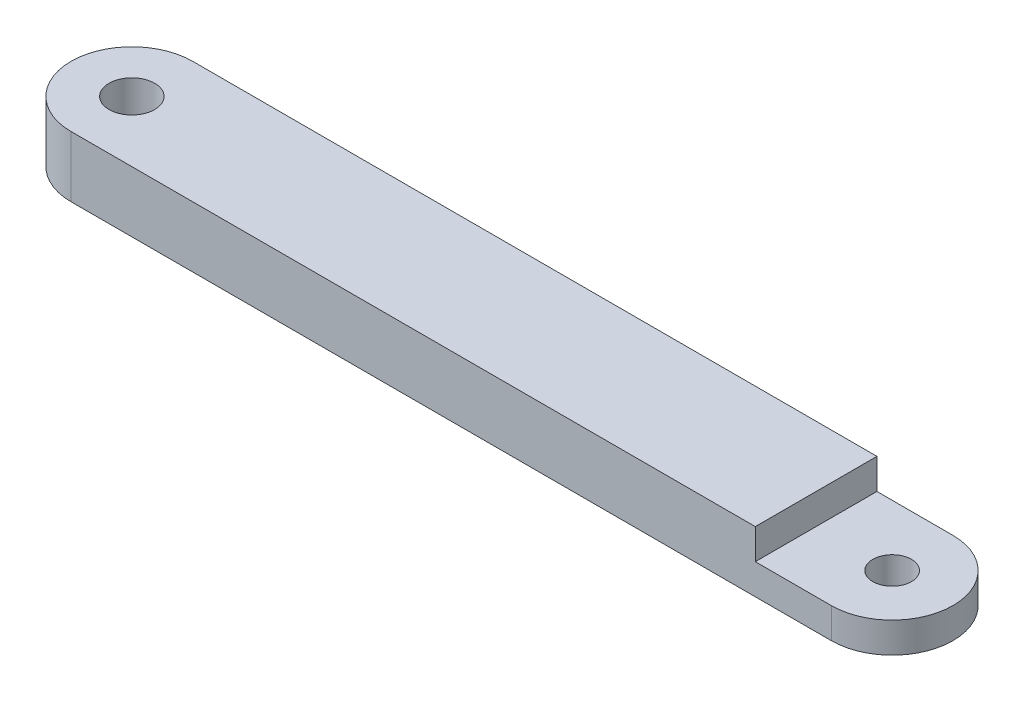
ISO-10303-21;
HEADER;
FILE_DESCRIPTION(('STEP AP214'),'2;1');
FILE_NAME('part.step','',(''),(''),'','','');
FILE_SCHEMA(('AUTOMOTIVE_DESIGN { 1 0 10303 214 1 1 1 1 }'));
ENDSEC;
DATA;
#1=APPLICATION_CONTEXT('core data for automotive mechanical design processes');
#2=APPLICATION_PROTOCOL_DEFINITION('international standard','automotive_design',2000,#1);
#3=PRODUCT_CONTEXT('',#1,'mechanical');
#4=PRODUCT('Part','Part','',(#3));
#5=PRODUCT_RELATED_PRODUCT_CATEGORY('part','',(#4));
#6=PRODUCT_DEFINITION_FORMATION('','',#4);
#7=PRODUCT_DEFINITION_CONTEXT('part definition',#1,'design');
#8=PRODUCT_DEFINITION('design','',#6,#7);
#9=PRODUCT_DEFINITION_SHAPE('','',#8);
#10=(LENGTH_UNIT() NAMED_UNIT(*) SI_UNIT(.MILLI.,.METRE.));
#11=(NAMED_UNIT(*) PLANE_ANGLE_UNIT() SI_UNIT($,.RADIAN.));
#12=(NAMED_UNIT(*) SI_UNIT($,.STERADIAN.) SOLID_ANGLE_UNIT());
#13=UNCERTAINTY_MEASURE_WITH_UNIT(LENGTH_MEASURE(1.E-05),#10,'distance_accuracy_value','');
#14=(GEOMETRIC_REPRESENTATION_CONTEXT(3) GLOBAL_UNCERTAINTY_ASSIGNED_CONTEXT((#13)) GLOBAL_UNIT_ASSIGNED_CONTEXT((#10,
#11,#12)) REPRESENTATION_CONTEXT('',''));
#15=CARTESIAN_POINT('',(0.,0.,0.));
#16=DIRECTION('',(0.,0.,1.));
#17=DIRECTION('',(1.,0.,0.));
#18=AXIS2_PLACEMENT_3D('',#15,#16,#17);
#19=CARTESIAN_POINT('',(39.6875,6.35,0.));
#20=DIRECTION('',(0.,-1.,0.));
#21=DIRECTION('',(0.,0.,-1.));
#22=AXIS2_PLACEMENT_3D('',#19,#20,#21);
#23=CYLINDRICAL_SURFACE('',#22,6.35);
#24=CARTESIAN_POINT('',(39.6875,3.175,0.));
#25=DIRECTION('',(0.,1.,0.));
#26=DIRECTION('',(0.,0.,1.));
#27=AXIS2_PLACEMENT_3D('',#24,#25,#26);
#28=CIRCLE('',#27,6.35);
#29=CARTESIAN_POINT('',(39.6875,3.175,6.34999999999998));
#30=VERTEX_POINT('',#29);
#31=CARTESIAN_POINT('',(39.6875,3.175,-6.35000000000001));
#32=VERTEX_POINT('',#31);
#33=EDGE_CURVE('E114',#30,#32,#28,.T.);
#34=ORIENTED_EDGE('',*,*,#33,.F.);
#35=DIRECTION('',(0.,-1.,0.));
#36=VECTOR('',#35,1.);
#37=CARTESIAN_POINT('',(39.6875,6.35,6.34999999999999));
#38=LINE('',#37,#36);
#39=CARTESIAN_POINT('',(39.6875,0.,6.34999999999999));
#40=VERTEX_POINT('',#39);
#41=EDGE_CURVE('E42',#30,#40,#38,.T.);
#42=ORIENTED_EDGE('',*,*,#41,.T.);
#43=CARTESIAN_POINT('',(39.6875,0.,0.));
#44=DIRECTION('',(0.,1.,0.));
#45=DIRECTION('',(0.,0.,1.));
#46=AXIS2_PLACEMENT_3D('',#43,#44,#45);
#47=CIRCLE('',#46,6.35);
#48=CARTESIAN_POINT('',(39.6875,0.,-6.35000000000001));
#49=VERTEX_POINT('',#48);
#50=EDGE_CURVE('E89',#40,#49,#47,.T.);
#51=ORIENTED_EDGE('',*,*,#50,.T.);
#52=DIRECTION('',(0.,-1.,0.));
#53=VECTOR('',#52,1.);
#54=CARTESIAN_POINT('',(39.6875,6.35,-6.35000000000001));
#55=LINE('',#54,#53);
#56=EDGE_CURVE('E83',#32,#49,#55,.T.);
#57=ORIENTED_EDGE('',*,*,#56,.F.);
#58=EDGE_LOOP('',(#34,#42,#51,#57));
#59=FACE_BOUND('',#58,.T.);
#60=ADVANCED_FACE('F33',(#59),#23,.T.);
#61=CARTESIAN_POINT('',(39.6875,6.35,0.));
#62=DIRECTION('',(0.,1.,0.));
#63=DIRECTION('',(0.,0.,1.));
#64=AXIS2_PLACEMENT_3D('',#61,#62,#63);
#65=CYLINDRICAL_SURFACE('',#64,2.0193);
#66=CARTESIAN_POINT('',(39.6875,0.,0.));
#67=DIRECTION('',(0.,1.,0.));
#68=DIRECTION('',(0.,0.,1.));
#69=AXIS2_PLACEMENT_3D('',#66,#67,#68);
#70=CIRCLE('',#69,2.0193);
#71=CARTESIAN_POINT('',(39.6875,0.,2.01929999999999));
#72=VERTEX_POINT('',#71);
#73=EDGE_CURVE('E130',#72,#72,#70,.T.);
#74=ORIENTED_EDGE('',*,*,#73,.F.);
#75=EDGE_LOOP('',(#74));
#76=FACE_BOUND('',#75,.T.);
#77=CARTESIAN_POINT('',(39.6875,3.175,0.));
#78=DIRECTION('',(0.,1.,0.));
#79=DIRECTION('',(0.,0.,1.));
#80=AXIS2_PLACEMENT_3D('',#77,#78,#79);
#81=CIRCLE('',#80,2.0193);
#82=CARTESIAN_POINT('',(39.6875,3.175,2.01929999999999));
#83=VERTEX_POINT('',#82);
#84=EDGE_CURVE('E37',#83,#83,#81,.F.);
#85=ORIENTED_EDGE('',*,*,#84,.F.);
#86=EDGE_LOOP('',(#85));
#87=FACE_BOUND('',#86,.T.);
#88=ADVANCED_FACE('F166',(#76,#87),#65,.F.);
#89=CARTESIAN_POINT('',(-39.6875,6.35,0.));
#90=DIRECTION('',(0.,-1.,0.));
#91=DIRECTION('',(0.,0.,-1.));
#92=AXIS2_PLACEMENT_3D('',#89,#90,#91);
#93=CYLINDRICAL_SURFACE('',#92,6.35);
#94=CARTESIAN_POINT('',(-39.6875,0.,0.));
#95=DIRECTION('',(0.,1.,0.));
#96=DIRECTION('',(0.,0.,1.));
#97=AXIS2_PLACEMENT_3D('',#94,#95,#96);
#98=CIRCLE('',#97,6.35);
#99=CARTESIAN_POINT('',(-39.6875,0.,-6.35));
#100=VERTEX_POINT('',#99);
#101=CARTESIAN_POINT('',(-39.6875,0.,6.35));
#102=VERTEX_POINT('',#101);
#103=EDGE_CURVE('E94',#100,#102,#98,.T.);
#104=ORIENTED_EDGE('',*,*,#103,.T.);
#105=DIRECTION('',(0.,-1.,0.));
#106=VECTOR('',#105,1.);
#107=CARTESIAN_POINT('',(-39.6875,6.35,6.35));
#108=LINE('',#107,#106);
#109=CARTESIAN_POINT('',(-39.6875,6.35,6.35));
#110=VERTEX_POINT('',#109);
#111=EDGE_CURVE('E11',#110,#102,#108,.T.);
#112=ORIENTED_EDGE('',*,*,#111,.F.);
#113=CARTESIAN_POINT('',(-39.6875,6.35,0.));
#114=DIRECTION('',(0.,1.,0.));
#115=DIRECTION('',(0.,0.,1.));
#116=AXIS2_PLACEMENT_3D('',#113,#114,#115);
#117=CIRCLE('',#116,6.35);
#118=CARTESIAN_POINT('',(-39.6875,6.35,-6.35));
#119=VERTEX_POINT('',#118);
#120=EDGE_CURVE('E88',#119,#110,#117,.T.);
#121=ORIENTED_EDGE('',*,*,#120,.F.);
#122=DIRECTION('',(0.,-1.,0.));
#123=VECTOR('',#122,1.);
#124=CARTESIAN_POINT('',(-39.6875,6.35,-6.35));
#125=LINE('',#124,#123);
#126=EDGE_CURVE('E79',#119,#100,#125,.T.);
#127=ORIENTED_EDGE('',*,*,#126,.T.);
#128=EDGE_LOOP('',(#104,#112,#121,#127));
#129=FACE_BOUND('',#128,.T.);
#130=ADVANCED_FACE('F35',(#129),#93,.T.);
#131=CARTESIAN_POINT('',(-39.6875,6.35,6.35));
#132=DIRECTION('',(0.,0.,-1.));
#133=DIRECTION('',(-1.,0.,0.));
#134=AXIS2_PLACEMENT_3D('',#131,#132,#133);
#135=PLANE('',#134);
#136=DIRECTION('',(1.,0.,0.));
#137=VECTOR('',#136,1.);
#138=CARTESIAN_POINT('',(47.625,3.175,6.34999999999998));
#139=LINE('',#138,#137);
#140=CARTESIAN_POINT('',(31.75,3.175,6.34999999999998));
#141=VERTEX_POINT('',#140);
#142=EDGE_CURVE('E142',#141,#30,#139,.T.);
#143=ORIENTED_EDGE('',*,*,#142,.F.);
#144=DIRECTION('',(0.,1.,0.));
#145=VECTOR('',#144,1.);
#146=CARTESIAN_POINT('',(31.75,3.175,6.34999999999998));
#147=LINE('',#146,#145);
#148=CARTESIAN_POINT('',(31.75,6.35,6.34999999999998));
#149=VERTEX_POINT('',#148);
#150=EDGE_CURVE('E123',#141,#149,#147,.T.);
#151=ORIENTED_EDGE('',*,*,#150,.T.);
#152=DIRECTION('',(1.,0.,0.));
#153=VECTOR('',#152,1.);
#154=CARTESIAN_POINT('',(-39.6875,6.35,6.35));
#155=LINE('',#154,#153);
#156=EDGE_CURVE('E120',#110,#149,#155,.T.);
#157=ORIENTED_EDGE('',*,*,#156,.F.);
#158=ORIENTED_EDGE('',*,*,#111,.T.);
#159=DIRECTION('',(1.,0.,0.));
#160=VECTOR('',#159,1.);
#161=CARTESIAN_POINT('',(-39.6875,0.,6.35));
#162=LINE('',#161,#160);
#163=EDGE_CURVE('E98',#102,#40,#162,.T.);
#164=ORIENTED_EDGE('',*,*,#163,.T.);
#165=ORIENTED_EDGE('',*,*,#41,.F.);
#166=EDGE_LOOP('',(#143,#151,#157,#158,#164,#165));
#167=FACE_BOUND('',#166,.T.);
#168=ADVANCED_FACE('F117',(#167),#135,.F.);
#169=CARTESIAN_POINT('',(-39.6875,6.35,-6.35));
#170=DIRECTION('',(0.,0.,1.));
#171=DIRECTION('',(1.,0.,0.));
#172=AXIS2_PLACEMENT_3D('',#169,#170,#171);
#173=PLANE('',#172);
#174=DIRECTION('',(-1.,0.,0.));
#175=VECTOR('',#174,1.);
#176=CARTESIAN_POINT('',(-39.6875,6.35,-6.35));
#177=LINE('',#176,#175);
#178=CARTESIAN_POINT('',(31.75,6.35,-6.35000000000001));
#179=VERTEX_POINT('',#178);
#180=EDGE_CURVE('E57',#179,#119,#177,.T.);
#181=ORIENTED_EDGE('',*,*,#180,.F.);
#182=DIRECTION('',(0.,1.,0.));
#183=VECTOR('',#182,1.);
#184=CARTESIAN_POINT('',(31.75,3.175,-6.35000000000001));
#185=LINE('',#184,#183);
#186=CARTESIAN_POINT('',(31.75,3.175,-6.35000000000001));
#187=VERTEX_POINT('',#186);
#188=EDGE_CURVE('E49',#187,#179,#185,.T.);
#189=ORIENTED_EDGE('',*,*,#188,.F.);
#190=DIRECTION('',(-1.,0.,0.));
#191=VECTOR('',#190,1.);
#192=CARTESIAN_POINT('',(47.625,3.175,-6.35000000000001));
#193=LINE('',#192,#191);
#194=EDGE_CURVE('E135',#32,#187,#193,.T.);
#195=ORIENTED_EDGE('',*,*,#194,.F.);
#196=ORIENTED_EDGE('',*,*,#56,.T.);
#197=DIRECTION('',(-1.,0.,0.));
#198=VECTOR('',#197,1.);
#199=CARTESIAN_POINT('',(-39.6875,0.,-6.35));
#200=LINE('',#199,#198);
#201=EDGE_CURVE('E76',#49,#100,#200,.T.);
#202=ORIENTED_EDGE('',*,*,#201,.T.);
#203=ORIENTED_EDGE('',*,*,#126,.F.);
#204=EDGE_LOOP('',(#181,#189,#195,#196,#202,#203));
#205=FACE_BOUND('',#204,.T.);
#206=ADVANCED_FACE('F78',(#205),#173,.F.);
#207=CARTESIAN_POINT('',(-39.6875,6.35,0.));
#208=DIRECTION('',(0.,1.,0.));
#209=DIRECTION('',(0.,0.,1.));
#210=AXIS2_PLACEMENT_3D('',#207,#208,#209);
#211=PLANE('',#210);
#212=DIRECTION('',(0.,0.,1.));
#213=VECTOR('',#212,1.);
#214=CARTESIAN_POINT('',(31.75,6.35,6.34999999999998));
#215=LINE('',#214,#213);
#216=EDGE_CURVE('E137',#179,#149,#215,.T.);
#217=ORIENTED_EDGE('',*,*,#216,.F.);
#218=ORIENTED_EDGE('',*,*,#180,.T.);
#219=ORIENTED_EDGE('',*,*,#120,.T.);
#220=ORIENTED_EDGE('',*,*,#156,.T.);
#221=EDGE_LOOP('',(#217,#218,#219,#220));
#222=FACE_BOUND('',#221,.T.);
#223=CARTESIAN_POINT('',(-39.6875,6.35,0.));
#224=DIRECTION('',(0.,1.,0.));
#225=DIRECTION('',(0.,0.,1.));
#226=AXIS2_PLACEMENT_3D('',#223,#224,#225);
#227=CIRCLE('',#226,2.38125);
#228=CARTESIAN_POINT('',(-39.6875,6.35,2.38125));
#229=VERTEX_POINT('',#228);
#230=EDGE_CURVE('E103',#229,#229,#227,.T.);
#231=ORIENTED_EDGE('',*,*,#230,.F.);
#232=EDGE_LOOP('',(#231));
#233=FACE_BOUND('',#232,.T.);
#234=ADVANCED_FACE('F124',(#222,#233),#211,.T.);
#235=CARTESIAN_POINT('',(-39.6875,0.,0.));
#236=DIRECTION('',(0.,1.,0.));
#237=DIRECTION('',(0.,0.,1.));
#238=AXIS2_PLACEMENT_3D('',#235,#236,#237);
#239=PLANE('',#238);
#240=ORIENTED_EDGE('',*,*,#73,.T.);
#241=EDGE_LOOP('',(#240));
#242=FACE_BOUND('',#241,.T.);
#243=CARTESIAN_POINT('',(-39.6875,0.,0.));
#244=DIRECTION('',(0.,1.,0.));
#245=DIRECTION('',(0.,0.,1.));
#246=AXIS2_PLACEMENT_3D('',#243,#244,#245);
#247=CIRCLE('',#246,2.38125);
#248=CARTESIAN_POINT('',(-39.6875,0.,2.38125));
#249=VERTEX_POINT('',#248);
#250=EDGE_CURVE('E99',#249,#249,#247,.T.);
#251=ORIENTED_EDGE('',*,*,#250,.T.);
#252=EDGE_LOOP('',(#251));
#253=FACE_BOUND('',#252,.T.);
#254=ORIENTED_EDGE('',*,*,#103,.F.);
#255=ORIENTED_EDGE('',*,*,#201,.F.);
#256=ORIENTED_EDGE('',*,*,#50,.F.);
#257=ORIENTED_EDGE('',*,*,#163,.F.);
#258=EDGE_LOOP('',(#254,#255,#256,#257));
#259=FACE_BOUND('',#258,.T.);
#260=ADVANCED_FACE('F96',(#242,#253,#259),#239,.F.);
#261=CARTESIAN_POINT('',(-39.6875,6.35,0.));
#262=DIRECTION('',(0.,1.,0.));
#263=DIRECTION('',(0.,0.,1.));
#264=AXIS2_PLACEMENT_3D('',#261,#262,#263);
#265=CYLINDRICAL_SURFACE('',#264,2.38125);
#266=ORIENTED_EDGE('',*,*,#250,.F.);
#267=EDGE_LOOP('',(#266));
#268=FACE_BOUND('',#267,.T.);
#269=ORIENTED_EDGE('',*,*,#230,.T.);
#270=EDGE_LOOP('',(#269));
#271=FACE_BOUND('',#270,.T.);
#272=ADVANCED_FACE('F161',(#268,#271),#265,.F.);
#273=CARTESIAN_POINT('',(0.,3.175,0.));
#274=DIRECTION('',(0.,1.,0.));
#275=DIRECTION('',(0.,0.,1.));
#276=AXIS2_PLACEMENT_3D('',#273,#274,#275);
#277=PLANE('',#276);
#278=ORIENTED_EDGE('',*,*,#84,.T.);
#279=EDGE_LOOP('',(#278));
#280=FACE_BOUND('',#279,.T.);
#281=ORIENTED_EDGE('',*,*,#33,.T.);
#282=ORIENTED_EDGE('',*,*,#194,.T.);
#283=DIRECTION('',(0.,0.,1.));
#284=VECTOR('',#283,1.);
#285=CARTESIAN_POINT('',(31.75,3.175,6.34999999999998));
#286=LINE('',#285,#284);
#287=EDGE_CURVE('E139',#187,#141,#286,.T.);
#288=ORIENTED_EDGE('',*,*,#287,.T.);
#289=ORIENTED_EDGE('',*,*,#142,.T.);
#290=EDGE_LOOP('',(#281,#282,#288,#289));
#291=FACE_BOUND('',#290,.T.);
#292=ADVANCED_FACE('F148',(#280,#291),#277,.T.);
#293=CARTESIAN_POINT('',(31.75,3.175,6.34999999999998));
#294=DIRECTION('',(-1.,0.,0.));
#295=DIRECTION('',(0.,0.,1.));
#296=AXIS2_PLACEMENT_3D('',#293,#294,#295);
#297=PLANE('',#296);
#298=ORIENTED_EDGE('',*,*,#216,.T.);
#299=ORIENTED_EDGE('',*,*,#150,.F.);
#300=ORIENTED_EDGE('',*,*,#287,.F.);
#301=ORIENTED_EDGE('',*,*,#188,.T.);
#302=EDGE_LOOP('',(#298,#299,#300,#301));
#303=FACE_BOUND('',#302,.T.);
#304=ADVANCED_FACE('F151',(#303),#297,.F.);
#305=CLOSED_SHELL('',(#60,#88,#130,#168,#206,#234,#260,#272,#292,#304));
#306=MANIFOLD_SOLID_BREP('B2',#305);
#307=ADVANCED_BREP_SHAPE_REPRESENTATION('',(#18,#306),#14);
#308=SHAPE_DEFINITION_REPRESENTATION(#9,#307);
ENDSEC;
END-ISO-10303-21;
